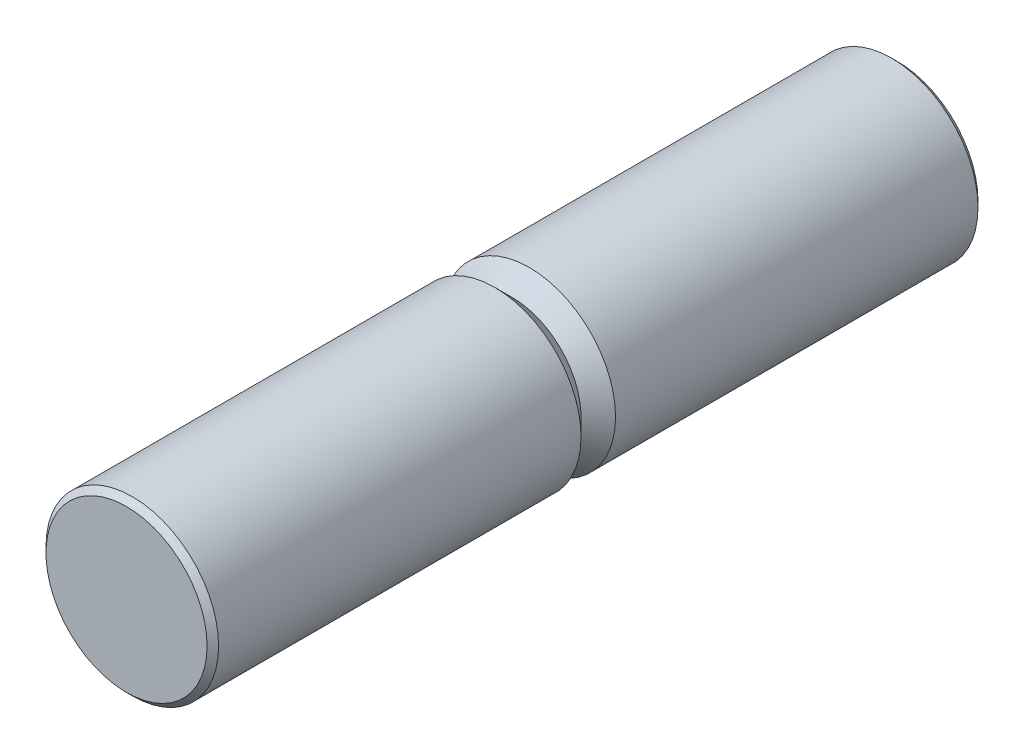
ISO-10303-21;
HEADER;
FILE_DESCRIPTION(('STEP AP214'),'2;1');
FILE_NAME('part.step','',(''),(''),'','','');
FILE_SCHEMA(('AUTOMOTIVE_DESIGN { 1 0 10303 214 1 1 1 1 }'));
ENDSEC;
DATA;
#1=APPLICATION_CONTEXT('core data for automotive mechanical design processes');
#2=APPLICATION_PROTOCOL_DEFINITION('international standard','automotive_design',2000,#1);
#3=PRODUCT_CONTEXT('',#1,'mechanical');
#4=PRODUCT('Part','Part','',(#3));
#5=PRODUCT_RELATED_PRODUCT_CATEGORY('part','',(#4));
#6=PRODUCT_DEFINITION_FORMATION('','',#4);
#7=PRODUCT_DEFINITION_CONTEXT('part definition',#1,'design');
#8=PRODUCT_DEFINITION('design','',#6,#7);
#9=PRODUCT_DEFINITION_SHAPE('','',#8);
#10=(LENGTH_UNIT() NAMED_UNIT(*) SI_UNIT(.MILLI.,.METRE.));
#11=(NAMED_UNIT(*) PLANE_ANGLE_UNIT() SI_UNIT($,.RADIAN.));
#12=(NAMED_UNIT(*) SI_UNIT($,.STERADIAN.) SOLID_ANGLE_UNIT());
#13=UNCERTAINTY_MEASURE_WITH_UNIT(LENGTH_MEASURE(1.E-05),#10,'distance_accuracy_value','');
#14=(GEOMETRIC_REPRESENTATION_CONTEXT(3) GLOBAL_UNCERTAINTY_ASSIGNED_CONTEXT((#13)) GLOBAL_UNIT_ASSIGNED_CONTEXT((#10,
#11,#12)) REPRESENTATION_CONTEXT('',''));
#15=CARTESIAN_POINT('',(0.,0.,0.));
#16=DIRECTION('',(0.,0.,1.));
#17=DIRECTION('',(1.,0.,0.));
#18=AXIS2_PLACEMENT_3D('',#15,#16,#17);
#19=CARTESIAN_POINT('',(0.,0.,33.5));
#20=DIRECTION('',(0.,0.,-0.999999999999999));
#21=DIRECTION('',(-1.,0.,0.));
#22=AXIS2_PLACEMENT_3D('',#19,#20,#21);
#23=CYLINDRICAL_SURFACE('',#22,7.5);
#24=CARTESIAN_POINT('',(0.,0.,-1.49999999999999));
#25=DIRECTION('',(0.,0.,-0.999999999999999));
#26=DIRECTION('',(-1.,0.,0.));
#27=AXIS2_PLACEMENT_3D('',#24,#25,#26);
#28=CIRCLE('',#27,7.5);
#29=CARTESIAN_POINT('',(-7.50000000000003,0.,-1.49999999999999));
#30=VERTEX_POINT('',#29);
#31=EDGE_CURVE('E72',#30,#30,#28,.T.);
#32=ORIENTED_EDGE('',*,*,#31,.T.);
#33=EDGE_LOOP('',(#32));
#34=FACE_BOUND('',#33,.T.);
#35=CARTESIAN_POINT('',(0.,0.,-33.));
#36=DIRECTION('',(0.,0.,0.999999999999999));
#37=DIRECTION('',(1.,0.,0.));
#38=AXIS2_PLACEMENT_3D('',#35,#36,#37);
#39=CIRCLE('',#38,7.5);
#40=CARTESIAN_POINT('',(7.49999999999996,0.,-33.));
#41=VERTEX_POINT('',#40);
#42=EDGE_CURVE('E52',#41,#41,#39,.T.);
#43=ORIENTED_EDGE('',*,*,#42,.T.);
#44=EDGE_LOOP('',(#43));
#45=FACE_BOUND('',#44,.T.);
#46=ADVANCED_FACE('F38',(#34,#45),#23,.T.);
#47=CARTESIAN_POINT('',(0.,0.,-33.5));
#48=DIRECTION('',(0.,0.,0.999999999999999));
#49=DIRECTION('',(1.,0.,0.));
#50=AXIS2_PLACEMENT_3D('',#47,#48,#49);
#51=PLANE('',#50);
#52=CARTESIAN_POINT('',(0.,0.,-33.5));
#53=DIRECTION('',(0.,0.,0.999999999999999));
#54=DIRECTION('',(1.,0.,0.));
#55=AXIS2_PLACEMENT_3D('',#52,#53,#54);
#56=CIRCLE('',#55,6.99999999999999);
#57=CARTESIAN_POINT('',(6.99999999999998,0.,-33.5));
#58=VERTEX_POINT('',#57);
#59=EDGE_CURVE('E46',#58,#58,#56,.F.);
#60=ORIENTED_EDGE('',*,*,#59,.T.);
#61=EDGE_LOOP('',(#60));
#62=FACE_BOUND('',#61,.T.);
#63=ADVANCED_FACE('F107',(#62),#51,.F.);
#64=CARTESIAN_POINT('',(0.,0.,-33.));
#65=DIRECTION('',(0.,0.,0.999999999999999));
#66=DIRECTION('',(1.,0.,0.));
#67=AXIS2_PLACEMENT_3D('',#64,#65,#66);
#68=CONICAL_SURFACE('',#67,7.5,0.785398163397457);
#69=ORIENTED_EDGE('',*,*,#59,.F.);
#70=EDGE_LOOP('',(#69));
#71=FACE_BOUND('',#70,.T.);
#72=ORIENTED_EDGE('',*,*,#42,.F.);
#73=EDGE_LOOP('',(#72));
#74=FACE_BOUND('',#73,.T.);
#75=ADVANCED_FACE('F84',(#71,#74),#68,.T.);
#76=CARTESIAN_POINT('',(0.,0.,0.));
#77=DIRECTION('',(0.,0.,-0.999999999999999));
#78=DIRECTION('',(-1.,0.,0.));
#79=AXIS2_PLACEMENT_3D('',#76,#77,#78);
#80=CONICAL_SURFACE('',#79,6.,0.785398163397446);
#81=ORIENTED_EDGE('',*,*,#31,.F.);
#82=EDGE_LOOP('',(#81));
#83=FACE_BOUND('',#82,.T.);
#84=CARTESIAN_POINT('',(0.,0.,0.));
#85=DIRECTION('',(0.,0.,-0.999999999999999));
#86=DIRECTION('',(-1.,0.,0.));
#87=AXIS2_PLACEMENT_3D('',#84,#85,#86);
#88=CIRCLE('',#87,6.);
#89=CARTESIAN_POINT('',(-6.,0.,0.));
#90=VERTEX_POINT('',#89);
#91=EDGE_CURVE('E64',#90,#90,#88,.T.);
#92=ORIENTED_EDGE('',*,*,#91,.T.);
#93=EDGE_LOOP('',(#92));
#94=FACE_BOUND('',#93,.T.);
#95=ADVANCED_FACE('F80',(#83,#94),#80,.T.);
#96=CARTESIAN_POINT('',(0.,0.,1.50000000000002));
#97=DIRECTION('',(0.,0.,0.999999999999999));
#98=DIRECTION('',(1.,0.,0.));
#99=AXIS2_PLACEMENT_3D('',#96,#97,#98);
#100=CONICAL_SURFACE('',#99,7.5,0.785398163397451);
#101=ORIENTED_EDGE('',*,*,#91,.F.);
#102=EDGE_LOOP('',(#101));
#103=FACE_BOUND('',#102,.T.);
#104=CARTESIAN_POINT('',(0.,0.,1.50000000000002));
#105=DIRECTION('',(0.,0.,-0.999999999999999));
#106=DIRECTION('',(-1.,0.,0.));
#107=AXIS2_PLACEMENT_3D('',#104,#105,#106);
#108=CIRCLE('',#107,7.5);
#109=CARTESIAN_POINT('',(-7.50000000000002,0.,1.50000000000001));
#110=VERTEX_POINT('',#109);
#111=EDGE_CURVE('E68',#110,#110,#108,.T.);
#112=ORIENTED_EDGE('',*,*,#111,.T.);
#113=EDGE_LOOP('',(#112));
#114=FACE_BOUND('',#113,.T.);
#115=ADVANCED_FACE('F83',(#103,#114),#100,.T.);
#116=CARTESIAN_POINT('',(0.,0.,33.5));
#117=DIRECTION('',(0.,0.,0.999999999999999));
#118=DIRECTION('',(1.,0.,0.));
#119=AXIS2_PLACEMENT_3D('',#116,#117,#118);
#120=PLANE('',#119);
#121=CARTESIAN_POINT('',(0.,0.,33.5));
#122=DIRECTION('',(0.,0.,0.999999999999999));
#123=DIRECTION('',(1.,0.,0.));
#124=AXIS2_PLACEMENT_3D('',#121,#122,#123);
#125=CIRCLE('',#124,6.99999999999999);
#126=CARTESIAN_POINT('',(7.00000000000002,0.,33.5));
#127=VERTEX_POINT('',#126);
#128=EDGE_CURVE('E10',#127,#127,#125,.T.);
#129=ORIENTED_EDGE('',*,*,#128,.T.);
#130=EDGE_LOOP('',(#129));
#131=FACE_BOUND('',#130,.T.);
#132=ADVANCED_FACE('F90',(#131),#120,.T.);
#133=CARTESIAN_POINT('',(0.,0.,33.5));
#134=DIRECTION('',(0.,0.,-0.999999999999999));
#135=DIRECTION('',(-1.,0.,0.));
#136=AXIS2_PLACEMENT_3D('',#133,#134,#135);
#137=CONICAL_SURFACE('',#136,6.99999999999999,0.785398163397457);
#138=CARTESIAN_POINT('',(0.,0.,33.));
#139=DIRECTION('',(0.,0.,0.999999999999999));
#140=DIRECTION('',(1.,0.,0.));
#141=AXIS2_PLACEMENT_3D('',#138,#139,#140);
#142=CIRCLE('',#141,7.5);
#143=CARTESIAN_POINT('',(7.50000000000002,0.,33.));
#144=VERTEX_POINT('',#143);
#145=EDGE_CURVE('E58',#144,#144,#142,.F.);
#146=ORIENTED_EDGE('',*,*,#145,.F.);
#147=EDGE_LOOP('',(#146));
#148=FACE_BOUND('',#147,.T.);
#149=ORIENTED_EDGE('',*,*,#128,.F.);
#150=EDGE_LOOP('',(#149));
#151=FACE_BOUND('',#150,.T.);
#152=ADVANCED_FACE('F96',(#148,#151),#137,.T.);
#153=ORIENTED_EDGE('',*,*,#111,.F.);
#154=EDGE_LOOP('',(#153));
#155=FACE_BOUND('',#154,.T.);
#156=ORIENTED_EDGE('',*,*,#145,.T.);
#157=EDGE_LOOP('',(#156));
#158=FACE_BOUND('',#157,.T.);
#159=ADVANCED_FACE('F40',(#155,#158),#23,.T.);
#160=CLOSED_SHELL('',(#46,#63,#75,#95,#115,#132,#152,#159));
#161=MANIFOLD_SOLID_BREP('B2',#160);
#162=ADVANCED_BREP_SHAPE_REPRESENTATION('',(#18,#161),#14);
#163=SHAPE_DEFINITION_REPRESENTATION(#9,#162);
ENDSEC;
END-ISO-10303-21;
